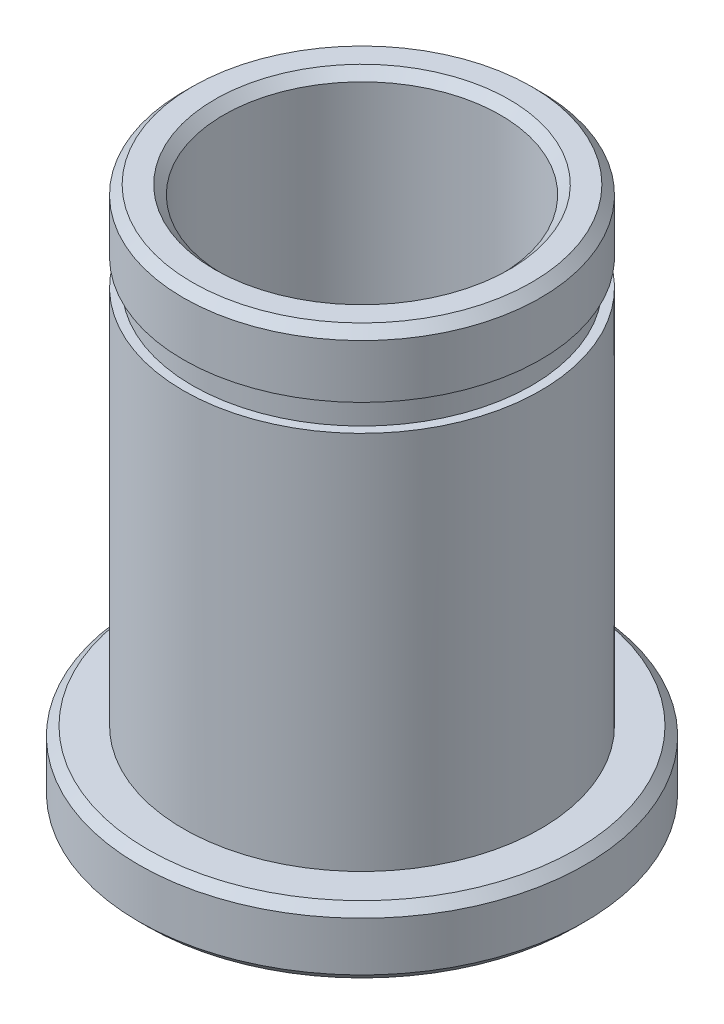
ISO-10303-21;
HEADER;
FILE_DESCRIPTION(('STEP AP214'),'2;1');
FILE_NAME('part.step','',(''),(''),'','','');
FILE_SCHEMA(('AUTOMOTIVE_DESIGN { 1 0 10303 214 1 1 1 1 }'));
ENDSEC;
DATA;
#1=APPLICATION_CONTEXT('core data for automotive mechanical design processes');
#2=APPLICATION_PROTOCOL_DEFINITION('international standard','automotive_design',2000,#1);
#3=PRODUCT_CONTEXT('',#1,'mechanical');
#4=PRODUCT('Part','Part','',(#3));
#5=PRODUCT_RELATED_PRODUCT_CATEGORY('part','',(#4));
#6=PRODUCT_DEFINITION_FORMATION('','',#4);
#7=PRODUCT_DEFINITION_CONTEXT('part definition',#1,'design');
#8=PRODUCT_DEFINITION('design','',#6,#7);
#9=PRODUCT_DEFINITION_SHAPE('','',#8);
#10=(LENGTH_UNIT() NAMED_UNIT(*) SI_UNIT(.MILLI.,.METRE.));
#11=(NAMED_UNIT(*) PLANE_ANGLE_UNIT() SI_UNIT($,.RADIAN.));
#12=(NAMED_UNIT(*) SI_UNIT($,.STERADIAN.) SOLID_ANGLE_UNIT());
#13=UNCERTAINTY_MEASURE_WITH_UNIT(LENGTH_MEASURE(1.E-05),#10,'distance_accuracy_value','');
#14=(GEOMETRIC_REPRESENTATION_CONTEXT(3) GLOBAL_UNCERTAINTY_ASSIGNED_CONTEXT((#13)) GLOBAL_UNIT_ASSIGNED_CONTEXT((#10,
#11,#12)) REPRESENTATION_CONTEXT('',''));
#15=CARTESIAN_POINT('',(0.,0.,0.));
#16=DIRECTION('',(0.,0.,1.));
#17=DIRECTION('',(1.,0.,0.));
#18=AXIS2_PLACEMENT_3D('',#15,#16,#17);
#19=CARTESIAN_POINT('',(0.,24.,0.));
#20=DIRECTION('',(0.,-1.,0.));
#21=DIRECTION('',(0.,0.,-1.));
#22=AXIS2_PLACEMENT_3D('',#19,#20,#21);
#23=CYLINDRICAL_SURFACE('',#22,8.);
#24=CARTESIAN_POINT('',(0.,3.,0.));
#25=DIRECTION('',(0.,-1.,0.));
#26=DIRECTION('',(0.,0.,-1.));
#27=AXIS2_PLACEMENT_3D('',#24,#25,#26);
#28=CIRCLE('',#27,8.);
#29=CARTESIAN_POINT('',(0.,3.,-8.));
#30=VERTEX_POINT('',#29);
#31=EDGE_CURVE('E78',#30,#30,#28,.T.);
#32=ORIENTED_EDGE('',*,*,#31,.F.);
#33=EDGE_LOOP('',(#32));
#34=FACE_BOUND('',#33,.T.);
#35=CARTESIAN_POINT('',(0.,20.,0.));
#36=DIRECTION('',(0.,1.,0.));
#37=DIRECTION('',(0.,0.,1.));
#38=AXIS2_PLACEMENT_3D('',#35,#36,#37);
#39=CIRCLE('',#38,8.);
#40=CARTESIAN_POINT('',(0.,20.,8.));
#41=VERTEX_POINT('',#40);
#42=EDGE_CURVE('E82',#41,#41,#39,.T.);
#43=ORIENTED_EDGE('',*,*,#42,.F.);
#44=EDGE_LOOP('',(#43));
#45=FACE_BOUND('',#44,.T.);
#46=ADVANCED_FACE('F39',(#34,#45),#23,.T.);
#47=CARTESIAN_POINT('',(0.,3.,0.));
#48=DIRECTION('',(0.,-1.,0.));
#49=DIRECTION('',(0.,0.,-1.));
#50=AXIS2_PLACEMENT_3D('',#47,#48,#49);
#51=CYLINDRICAL_SURFACE('',#50,10.);
#52=CARTESIAN_POINT('',(0.,0.399999999999991,0.));
#53=DIRECTION('',(0.,1.,0.));
#54=DIRECTION('',(0.,0.,1.));
#55=AXIS2_PLACEMENT_3D('',#52,#53,#54);
#56=CIRCLE('',#55,10.);
#57=CARTESIAN_POINT('',(0.,0.399999999999991,10.));
#58=VERTEX_POINT('',#57);
#59=EDGE_CURVE('E55',#58,#58,#56,.T.);
#60=ORIENTED_EDGE('',*,*,#59,.T.);
#61=EDGE_LOOP('',(#60));
#62=FACE_BOUND('',#61,.T.);
#63=CARTESIAN_POINT('',(0.,2.6,0.));
#64=DIRECTION('',(0.,-1.,0.));
#65=DIRECTION('',(0.,0.,-1.));
#66=AXIS2_PLACEMENT_3D('',#63,#64,#65);
#67=CIRCLE('',#66,10.);
#68=CARTESIAN_POINT('',(0.,2.6,-10.));
#69=VERTEX_POINT('',#68);
#70=EDGE_CURVE('E60',#69,#69,#67,.T.);
#71=ORIENTED_EDGE('',*,*,#70,.T.);
#72=EDGE_LOOP('',(#71));
#73=FACE_BOUND('',#72,.T.);
#74=ADVANCED_FACE('F115',(#62,#73),#51,.T.);
#75=CARTESIAN_POINT('',(0.,3.,0.));
#76=DIRECTION('',(0.,-1.,0.));
#77=DIRECTION('',(0.,0.,-1.));
#78=AXIS2_PLACEMENT_3D('',#75,#76,#77);
#79=PLANE('',#78);
#80=CARTESIAN_POINT('',(0.,3.,0.));
#81=DIRECTION('',(0.,-1.,0.));
#82=DIRECTION('',(0.,0.,-1.));
#83=AXIS2_PLACEMENT_3D('',#80,#81,#82);
#84=CIRCLE('',#83,9.6);
#85=CARTESIAN_POINT('',(0.,3.,-9.6));
#86=VERTEX_POINT('',#85);
#87=EDGE_CURVE('E51',#86,#86,#84,.F.);
#88=ORIENTED_EDGE('',*,*,#87,.T.);
#89=EDGE_LOOP('',(#88));
#90=FACE_BOUND('',#89,.T.);
#91=ORIENTED_EDGE('',*,*,#31,.T.);
#92=EDGE_LOOP('',(#91));
#93=FACE_BOUND('',#92,.T.);
#94=ADVANCED_FACE('F122',(#90,#93),#79,.F.);
#95=CARTESIAN_POINT('',(0.,0.,0.));
#96=DIRECTION('',(0.,1.,0.));
#97=DIRECTION('',(0.,0.,1.));
#98=AXIS2_PLACEMENT_3D('',#95,#96,#97);
#99=PLANE('',#98);
#100=CARTESIAN_POINT('',(0.,0.,0.));
#101=DIRECTION('',(0.,1.,0.));
#102=DIRECTION('',(0.,0.,1.));
#103=AXIS2_PLACEMENT_3D('',#100,#101,#102);
#104=CIRCLE('',#103,9.60000000000001);
#105=CARTESIAN_POINT('',(0.,0.,9.60000000000001));
#106=VERTEX_POINT('',#105);
#107=EDGE_CURVE('E63',#106,#106,#104,.F.);
#108=ORIENTED_EDGE('',*,*,#107,.T.);
#109=EDGE_LOOP('',(#108));
#110=FACE_BOUND('',#109,.T.);
#111=CARTESIAN_POINT('',(0.,0.,0.));
#112=DIRECTION('',(0.,1.,0.));
#113=DIRECTION('',(0.,0.,1.));
#114=AXIS2_PLACEMENT_3D('',#111,#112,#113);
#115=CIRCLE('',#114,6.6);
#116=CARTESIAN_POINT('',(0.,0.,6.6));
#117=VERTEX_POINT('',#116);
#118=EDGE_CURVE('E69',#117,#117,#115,.T.);
#119=ORIENTED_EDGE('',*,*,#118,.T.);
#120=EDGE_LOOP('',(#119));
#121=FACE_BOUND('',#120,.T.);
#122=ADVANCED_FACE('F110',(#110,#121),#99,.F.);
#123=CARTESIAN_POINT('',(0.,21.2,0.));
#124=DIRECTION('',(0.,1.,0.));
#125=DIRECTION('',(0.,0.,1.));
#126=AXIS2_PLACEMENT_3D('',#123,#124,#125);
#127=PLANE('',#126);
#128=CARTESIAN_POINT('',(0.,21.2,0.));
#129=DIRECTION('',(0.,1.,0.));
#130=DIRECTION('',(0.,0.,1.));
#131=AXIS2_PLACEMENT_3D('',#128,#129,#130);
#132=CIRCLE('',#131,8.);
#133=CARTESIAN_POINT('',(0.,21.2,8.));
#134=VERTEX_POINT('',#133);
#135=EDGE_CURVE('E81',#134,#134,#132,.T.);
#136=ORIENTED_EDGE('',*,*,#135,.F.);
#137=EDGE_LOOP('',(#136));
#138=FACE_BOUND('',#137,.T.);
#139=CARTESIAN_POINT('',(0.,21.2,0.));
#140=DIRECTION('',(0.,1.,0.));
#141=DIRECTION('',(0.,0.,1.));
#142=AXIS2_PLACEMENT_3D('',#139,#140,#141);
#143=CIRCLE('',#142,7.6);
#144=CARTESIAN_POINT('',(0.,21.2,7.6));
#145=VERTEX_POINT('',#144);
#146=EDGE_CURVE('E85',#145,#145,#143,.T.);
#147=ORIENTED_EDGE('',*,*,#146,.T.);
#148=EDGE_LOOP('',(#147));
#149=FACE_BOUND('',#148,.T.);
#150=ADVANCED_FACE('F94',(#138,#149),#127,.F.);
#151=CARTESIAN_POINT('',(0.,20.,0.));
#152=DIRECTION('',(0.,1.,0.));
#153=DIRECTION('',(0.,0.,1.));
#154=AXIS2_PLACEMENT_3D('',#151,#152,#153);
#155=PLANE('',#154);
#156=ORIENTED_EDGE('',*,*,#42,.T.);
#157=EDGE_LOOP('',(#156));
#158=FACE_BOUND('',#157,.T.);
#159=CARTESIAN_POINT('',(0.,20.,0.));
#160=DIRECTION('',(0.,1.,0.));
#161=DIRECTION('',(0.,0.,1.));
#162=AXIS2_PLACEMENT_3D('',#159,#160,#161);
#163=CIRCLE('',#162,7.6);
#164=CARTESIAN_POINT('',(0.,20.,7.6));
#165=VERTEX_POINT('',#164);
#166=EDGE_CURVE('E88',#165,#165,#163,.T.);
#167=ORIENTED_EDGE('',*,*,#166,.F.);
#168=EDGE_LOOP('',(#167));
#169=FACE_BOUND('',#168,.T.);
#170=ADVANCED_FACE('F100',(#158,#169),#155,.T.);
#171=CARTESIAN_POINT('',(0.,21.2,0.));
#172=DIRECTION('',(0.,-1.,0.));
#173=DIRECTION('',(0.,0.,-1.));
#174=AXIS2_PLACEMENT_3D('',#171,#172,#173);
#175=CYLINDRICAL_SURFACE('',#174,7.6);
#176=ORIENTED_EDGE('',*,*,#146,.F.);
#177=EDGE_LOOP('',(#176));
#178=FACE_BOUND('',#177,.T.);
#179=ORIENTED_EDGE('',*,*,#166,.T.);
#180=EDGE_LOOP('',(#179));
#181=FACE_BOUND('',#180,.T.);
#182=ADVANCED_FACE('F96',(#178,#181),#175,.T.);
#183=CARTESIAN_POINT('',(0.,24.,0.));
#184=DIRECTION('',(0.,1.,0.));
#185=DIRECTION('',(0.,0.,1.));
#186=AXIS2_PLACEMENT_3D('',#183,#184,#185);
#187=PLANE('',#186);
#188=CARTESIAN_POINT('',(0.,24.,0.));
#189=DIRECTION('',(0.,1.,0.));
#190=DIRECTION('',(0.,0.,1.));
#191=AXIS2_PLACEMENT_3D('',#188,#189,#190);
#192=CIRCLE('',#191,7.6);
#193=CARTESIAN_POINT('',(0.,24.,7.6));
#194=VERTEX_POINT('',#193);
#195=EDGE_CURVE('E47',#194,#194,#192,.T.);
#196=ORIENTED_EDGE('',*,*,#195,.T.);
#197=EDGE_LOOP('',(#196));
#198=FACE_BOUND('',#197,.T.);
#199=CARTESIAN_POINT('',(0.,24.,0.));
#200=DIRECTION('',(0.,1.,0.));
#201=DIRECTION('',(0.,0.,1.));
#202=AXIS2_PLACEMENT_3D('',#199,#200,#201);
#203=CIRCLE('',#202,6.6);
#204=CARTESIAN_POINT('',(0.,24.,6.6));
#205=VERTEX_POINT('',#204);
#206=EDGE_CURVE('E66',#205,#205,#203,.F.);
#207=ORIENTED_EDGE('',*,*,#206,.T.);
#208=EDGE_LOOP('',(#207));
#209=FACE_BOUND('',#208,.T.);
#210=ADVANCED_FACE('F99',(#198,#209),#187,.T.);
#211=CARTESIAN_POINT('',(0.,23.6,0.));
#212=DIRECTION('',(0.,1.,0.));
#213=DIRECTION('',(0.,0.,1.));
#214=AXIS2_PLACEMENT_3D('',#211,#212,#213);
#215=CIRCLE('',#214,8.);
#216=CARTESIAN_POINT('',(0.,23.6,8.));
#217=VERTEX_POINT('',#216);
#218=EDGE_CURVE('E10',#217,#217,#215,.F.);
#219=ORIENTED_EDGE('',*,*,#218,.T.);
#220=EDGE_LOOP('',(#219));
#221=FACE_BOUND('',#220,.T.);
#222=ORIENTED_EDGE('',*,*,#135,.T.);
#223=EDGE_LOOP('',(#222));
#224=FACE_BOUND('',#223,.T.);
#225=ADVANCED_FACE('F118',(#221,#224),#23,.T.);
#226=CARTESIAN_POINT('',(0.,24.,0.));
#227=DIRECTION('',(0.,-1.,0.));
#228=DIRECTION('',(0.,0.,-1.));
#229=AXIS2_PLACEMENT_3D('',#226,#227,#228);
#230=CYLINDRICAL_SURFACE('',#229,6.2);
#231=CARTESIAN_POINT('',(0.,0.399999999999998,0.));
#232=DIRECTION('',(0.,1.,0.));
#233=DIRECTION('',(0.,0.,1.));
#234=AXIS2_PLACEMENT_3D('',#231,#232,#233);
#235=CIRCLE('',#234,6.2);
#236=CARTESIAN_POINT('',(0.,0.399999999999998,6.2));
#237=VERTEX_POINT('',#236);
#238=EDGE_CURVE('E72',#237,#237,#235,.F.);
#239=ORIENTED_EDGE('',*,*,#238,.T.);
#240=EDGE_LOOP('',(#239));
#241=FACE_BOUND('',#240,.T.);
#242=CARTESIAN_POINT('',(0.,23.6,0.));
#243=DIRECTION('',(0.,1.,0.));
#244=DIRECTION('',(0.,0.,1.));
#245=AXIS2_PLACEMENT_3D('',#242,#243,#244);
#246=CIRCLE('',#245,6.2);
#247=CARTESIAN_POINT('',(0.,23.6,6.2));
#248=VERTEX_POINT('',#247);
#249=EDGE_CURVE('E75',#248,#248,#246,.T.);
#250=ORIENTED_EDGE('',*,*,#249,.T.);
#251=EDGE_LOOP('',(#250));
#252=FACE_BOUND('',#251,.T.);
#253=ADVANCED_FACE('F130',(#241,#252),#230,.F.);
#254=CARTESIAN_POINT('',(0.,0.399999999999998,0.));
#255=DIRECTION('',(0.,-1.,0.));
#256=DIRECTION('',(0.,0.,-1.));
#257=AXIS2_PLACEMENT_3D('',#254,#255,#256);
#258=CONICAL_SURFACE('',#257,6.2,0.785398163397449);
#259=ORIENTED_EDGE('',*,*,#118,.F.);
#260=EDGE_LOOP('',(#259));
#261=FACE_BOUND('',#260,.T.);
#262=ORIENTED_EDGE('',*,*,#238,.F.);
#263=EDGE_LOOP('',(#262));
#264=FACE_BOUND('',#263,.T.);
#265=ADVANCED_FACE('F136',(#261,#264),#258,.F.);
#266=CARTESIAN_POINT('',(0.,24.,0.));
#267=DIRECTION('',(0.,1.,0.));
#268=DIRECTION('',(0.,0.,1.));
#269=AXIS2_PLACEMENT_3D('',#266,#267,#268);
#270=CONICAL_SURFACE('',#269,6.6,0.785398163397445);
#271=ORIENTED_EDGE('',*,*,#249,.F.);
#272=EDGE_LOOP('',(#271));
#273=FACE_BOUND('',#272,.T.);
#274=ORIENTED_EDGE('',*,*,#206,.F.);
#275=EDGE_LOOP('',(#274));
#276=FACE_BOUND('',#275,.T.);
#277=ADVANCED_FACE('F157',(#273,#276),#270,.F.);
#278=CARTESIAN_POINT('',(0.,0.,0.));
#279=DIRECTION('',(0.,1.,0.));
#280=DIRECTION('',(0.,0.,1.));
#281=AXIS2_PLACEMENT_3D('',#278,#279,#280);
#282=CONICAL_SURFACE('',#281,9.60000000000001,0.785398163397446);
#283=ORIENTED_EDGE('',*,*,#59,.F.);
#284=EDGE_LOOP('',(#283));
#285=FACE_BOUND('',#284,.T.);
#286=ORIENTED_EDGE('',*,*,#107,.F.);
#287=EDGE_LOOP('',(#286));
#288=FACE_BOUND('',#287,.T.);
#289=ADVANCED_FACE('F164',(#285,#288),#282,.T.);
#290=CARTESIAN_POINT('',(0.,2.6,0.));
#291=DIRECTION('',(0.,-1.,0.));
#292=DIRECTION('',(0.,0.,-1.));
#293=AXIS2_PLACEMENT_3D('',#290,#291,#292);
#294=CONICAL_SURFACE('',#293,10.,0.785398163397448);
#295=ORIENTED_EDGE('',*,*,#87,.F.);
#296=EDGE_LOOP('',(#295));
#297=FACE_BOUND('',#296,.T.);
#298=ORIENTED_EDGE('',*,*,#70,.F.);
#299=EDGE_LOOP('',(#298));
#300=FACE_BOUND('',#299,.T.);
#301=ADVANCED_FACE('F169',(#297,#300),#294,.T.);
#302=CARTESIAN_POINT('',(0.,24.,0.));
#303=DIRECTION('',(0.,-1.,0.));
#304=DIRECTION('',(0.,0.,-1.));
#305=AXIS2_PLACEMENT_3D('',#302,#303,#304);
#306=CONICAL_SURFACE('',#305,7.6,0.785398163397448);
#307=ORIENTED_EDGE('',*,*,#218,.F.);
#308=EDGE_LOOP('',(#307));
#309=FACE_BOUND('',#308,.T.);
#310=ORIENTED_EDGE('',*,*,#195,.F.);
#311=EDGE_LOOP('',(#310));
#312=FACE_BOUND('',#311,.T.);
#313=ADVANCED_FACE('F42',(#309,#312),#306,.T.);
#314=CLOSED_SHELL('',(#46,#74,#94,#122,#150,#170,#182,#210,#225,#253,#265,#277,#289,#301,#313));
#315=MANIFOLD_SOLID_BREP('B2',#314);
#316=ADVANCED_BREP_SHAPE_REPRESENTATION('',(#18,#315),#14);
#317=SHAPE_DEFINITION_REPRESENTATION(#9,#316);
ENDSEC;
END-ISO-10303-21;
